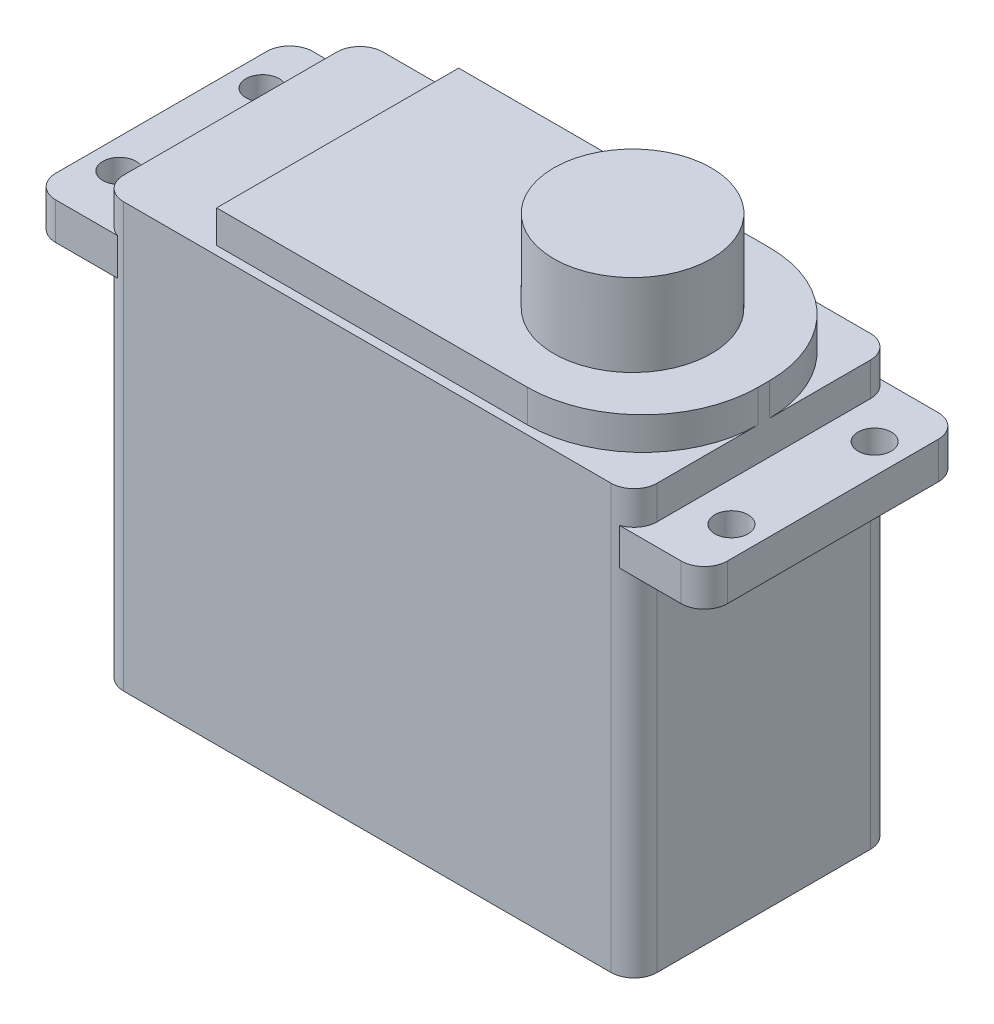
ISO-10303-21;
HEADER;
FILE_DESCRIPTION(('STEP AP214'),'2;1');
FILE_NAME('part.step','',(''),(''),'','','');
FILE_SCHEMA(('AUTOMOTIVE_DESIGN { 1 0 10303 214 1 1 1 1 }'));
ENDSEC;
DATA;
#1=APPLICATION_CONTEXT('core data for automotive mechanical design processes');
#2=APPLICATION_PROTOCOL_DEFINITION('international standard','automotive_design',2000,#1);
#3=PRODUCT_CONTEXT('',#1,'mechanical');
#4=PRODUCT('Part','Part','',(#3));
#5=PRODUCT_RELATED_PRODUCT_CATEGORY('part','',(#4));
#6=PRODUCT_DEFINITION_FORMATION('','',#4);
#7=PRODUCT_DEFINITION_CONTEXT('part definition',#1,'design');
#8=PRODUCT_DEFINITION('design','',#6,#7);
#9=PRODUCT_DEFINITION_SHAPE('','',#8);
#10=(LENGTH_UNIT() NAMED_UNIT(*) SI_UNIT(.MILLI.,.METRE.));
#11=(NAMED_UNIT(*) PLANE_ANGLE_UNIT() SI_UNIT($,.RADIAN.));
#12=(NAMED_UNIT(*) SI_UNIT($,.STERADIAN.) SOLID_ANGLE_UNIT());
#13=UNCERTAINTY_MEASURE_WITH_UNIT(LENGTH_MEASURE(1.E-05),#10,'distance_accuracy_value','');
#14=(GEOMETRIC_REPRESENTATION_CONTEXT(3) GLOBAL_UNCERTAINTY_ASSIGNED_CONTEXT((#13)) GLOBAL_UNIT_ASSIGNED_CONTEXT((#10,
#11,#12)) REPRESENTATION_CONTEXT('',''));
#15=CARTESIAN_POINT('',(0.,0.,0.));
#16=DIRECTION('',(0.,0.,1.));
#17=DIRECTION('',(1.,0.,0.));
#18=AXIS2_PLACEMENT_3D('',#15,#16,#17);
#19=CARTESIAN_POINT('',(0.,50.1904,0.));
#20=DIRECTION('',(0.,-1.,0.));
#21=DIRECTION('',(0.,0.,-1.));
#22=AXIS2_PLACEMENT_3D('',#19,#20,#21);
#23=PLANE('',#22);
#24=DIRECTION('',(1.,0.,0.));
#25=VECTOR('',#24,1.);
#26=CARTESIAN_POINT('',(29.337,50.1904,13.3096));
#27=LINE('',#26,#25);
#28=CARTESIAN_POINT('',(-17.526,50.1904,13.3096));
#29=VERTEX_POINT('',#28);
#30=CARTESIAN_POINT('',(16.637,50.1904,13.3096));
#31=VERTEX_POINT('',#30);
#32=EDGE_CURVE('E270',#29,#31,#27,.T.);
#33=ORIENTED_EDGE('',*,*,#32,.T.);
#34=CARTESIAN_POINT('',(16.637,50.1904,0.609600000000004));
#35=DIRECTION('',(0.,-1.,0.));
#36=DIRECTION('',(0.,0.,-1.));
#37=AXIS2_PLACEMENT_3D('',#34,#35,#36);
#38=CIRCLE('',#37,12.7);
#39=CARTESIAN_POINT('',(29.337,50.1904,0.609600000000004));
#40=VERTEX_POINT('',#39);
#41=EDGE_CURVE('E299',#31,#40,#38,.F.);
#42=ORIENTED_EDGE('',*,*,#41,.T.);
#43=DIRECTION('',(0.,0.,-1.));
#44=VECTOR('',#43,1.);
#45=CARTESIAN_POINT('',(29.337,50.1904,13.3096));
#46=LINE('',#45,#44);
#47=CARTESIAN_POINT('',(29.337,50.1904,-0.609600000000014));
#48=VERTEX_POINT('',#47);
#49=EDGE_CURVE('E273',#40,#48,#46,.T.);
#50=ORIENTED_EDGE('',*,*,#49,.T.);
#51=CARTESIAN_POINT('',(16.637,50.1904,-0.609600000000013));
#52=DIRECTION('',(0.,-1.,0.));
#53=DIRECTION('',(0.,0.,-1.));
#54=AXIS2_PLACEMENT_3D('',#51,#52,#53);
#55=CIRCLE('',#54,12.7);
#56=CARTESIAN_POINT('',(16.637,50.1904,-13.3096));
#57=VERTEX_POINT('',#56);
#58=EDGE_CURVE('E297',#48,#57,#55,.F.);
#59=ORIENTED_EDGE('',*,*,#58,.T.);
#60=DIRECTION('',(-1.,0.,0.));
#61=VECTOR('',#60,1.);
#62=CARTESIAN_POINT('',(29.337,50.1904,-13.3096));
#63=LINE('',#62,#61);
#64=CARTESIAN_POINT('',(-17.526,50.1904,-13.3096));
#65=VERTEX_POINT('',#64);
#66=EDGE_CURVE('E277',#57,#65,#63,.T.);
#67=ORIENTED_EDGE('',*,*,#66,.T.);
#68=DIRECTION('',(0.,0.,1.));
#69=VECTOR('',#68,1.);
#70=CARTESIAN_POINT('',(-17.526,50.1904,13.3096));
#71=LINE('',#70,#69);
#72=EDGE_CURVE('E279',#65,#29,#71,.T.);
#73=ORIENTED_EDGE('',*,*,#72,.T.);
#74=EDGE_LOOP('',(#33,#42,#50,#59,#67,#73));
#75=FACE_BOUND('',#74,.T.);
#76=CARTESIAN_POINT('',(14.9098,50.1904,0.));
#77=DIRECTION('',(0.,-1.,0.));
#78=DIRECTION('',(0.,0.,-1.));
#79=AXIS2_PLACEMENT_3D('',#76,#77,#78);
#80=CIRCLE('',#79,8.6614);
#81=CARTESIAN_POINT('',(14.9098,50.1904,-8.66140000000001));
#82=VERTEX_POINT('',#81);
#83=EDGE_CURVE('E11',#82,#82,#80,.F.);
#84=ORIENTED_EDGE('',*,*,#83,.F.);
#85=EDGE_LOOP('',(#84));
#86=FACE_BOUND('',#85,.T.);
#87=ADVANCED_FACE('F33',(#75,#86),#23,.F.);
#88=CARTESIAN_POINT('',(-29.337,46.609,14.2621));
#89=DIRECTION('',(1.,0.,0.));
#90=DIRECTION('',(0.,0.,-1.));
#91=AXIS2_PLACEMENT_3D('',#88,#89,#90);
#92=PLANE('',#91);
#93=DIRECTION('',(0.,0.,1.));
#94=VECTOR('',#93,1.);
#95=CARTESIAN_POINT('',(-29.337,38.862,14.2621));
#96=LINE('',#95,#94);
#97=CARTESIAN_POINT('',(-29.337,38.862,-11.7221));
#98=VERTEX_POINT('',#97);
#99=CARTESIAN_POINT('',(-29.337,38.862,11.7221));
#100=VERTEX_POINT('',#99);
#101=EDGE_CURVE('E474',#98,#100,#96,.T.);
#102=ORIENTED_EDGE('',*,*,#101,.F.);
#103=DIRECTION('',(0.,-1.,0.));
#104=VECTOR('',#103,1.);
#105=CARTESIAN_POINT('',(-29.337,46.609,-11.7221));
#106=LINE('',#105,#104);
#107=CARTESIAN_POINT('',(-29.337,0.,-11.7221));
#108=VERTEX_POINT('',#107);
#109=EDGE_CURVE('E386',#98,#108,#106,.T.);
#110=ORIENTED_EDGE('',*,*,#109,.T.);
#111=DIRECTION('',(0.,0.,1.));
#112=VECTOR('',#111,1.);
#113=CARTESIAN_POINT('',(-29.337,0.,14.2621));
#114=LINE('',#113,#112);
#115=CARTESIAN_POINT('',(-29.337,0.,11.7221));
#116=VERTEX_POINT('',#115);
#117=EDGE_CURVE('E335',#108,#116,#114,.T.);
#118=ORIENTED_EDGE('',*,*,#117,.T.);
#119=DIRECTION('',(0.,-1.,0.));
#120=VECTOR('',#119,1.);
#121=CARTESIAN_POINT('',(-29.337,46.609,11.7221));
#122=LINE('',#121,#120);
#123=EDGE_CURVE('E384',#116,#100,#122,.F.);
#124=ORIENTED_EDGE('',*,*,#123,.T.);
#125=EDGE_LOOP('',(#102,#110,#118,#124));
#126=FACE_BOUND('',#125,.T.);
#127=ADVANCED_FACE('F586',(#126),#92,.F.);
#128=CARTESIAN_POINT('',(29.337,46.609,14.2621));
#129=DIRECTION('',(-1.,0.,0.));
#130=DIRECTION('',(0.,0.,1.));
#131=AXIS2_PLACEMENT_3D('',#128,#129,#130);
#132=PLANE('',#131);
#133=DIRECTION('',(0.,0.,-1.));
#134=VECTOR('',#133,1.);
#135=CARTESIAN_POINT('',(29.337,38.862,14.2621));
#136=LINE('',#135,#134);
#137=CARTESIAN_POINT('',(29.337,38.862,11.7221));
#138=VERTEX_POINT('',#137);
#139=CARTESIAN_POINT('',(29.337,38.862,-11.7221));
#140=VERTEX_POINT('',#139);
#141=EDGE_CURVE('E250',#138,#140,#136,.T.);
#142=ORIENTED_EDGE('',*,*,#141,.F.);
#143=DIRECTION('',(0.,-1.,0.));
#144=VECTOR('',#143,1.);
#145=CARTESIAN_POINT('',(29.337,46.609,11.7221));
#146=LINE('',#145,#144);
#147=CARTESIAN_POINT('',(29.337,0.,11.7221));
#148=VERTEX_POINT('',#147);
#149=EDGE_CURVE('E503',#138,#148,#146,.T.);
#150=ORIENTED_EDGE('',*,*,#149,.T.);
#151=DIRECTION('',(0.,0.,-1.));
#152=VECTOR('',#151,1.);
#153=CARTESIAN_POINT('',(29.337,0.,14.2621));
#154=LINE('',#153,#152);
#155=CARTESIAN_POINT('',(29.337,0.,-11.7221));
#156=VERTEX_POINT('',#155);
#157=EDGE_CURVE('E330',#148,#156,#154,.T.);
#158=ORIENTED_EDGE('',*,*,#157,.T.);
#159=DIRECTION('',(0.,-1.,0.));
#160=VECTOR('',#159,1.);
#161=CARTESIAN_POINT('',(29.337,46.609,-11.7221));
#162=LINE('',#161,#160);
#163=EDGE_CURVE('E315',#156,#140,#162,.F.);
#164=ORIENTED_EDGE('',*,*,#163,.T.);
#165=EDGE_LOOP('',(#142,#150,#158,#164));
#166=FACE_BOUND('',#165,.T.);
#167=ADVANCED_FACE('F505',(#166),#132,.F.);
#168=CARTESIAN_POINT('',(-29.337,46.609,-11.7221));
#169=VERTEX_POINT('',#168);
#170=CARTESIAN_POINT('',(-29.337,42.926,-11.7221));
#171=VERTEX_POINT('',#170);
#172=EDGE_CURVE('E387',#169,#171,#106,.T.);
#173=ORIENTED_EDGE('',*,*,#172,.T.);
#174=DIRECTION('',(0.,0.,1.));
#175=VECTOR('',#174,1.);
#176=CARTESIAN_POINT('',(-29.337,42.926,14.2621));
#177=LINE('',#176,#175);
#178=CARTESIAN_POINT('',(-29.337,42.926,11.7221));
#179=VERTEX_POINT('',#178);
#180=EDGE_CURVE('E490',#171,#179,#177,.T.);
#181=ORIENTED_EDGE('',*,*,#180,.T.);
#182=CARTESIAN_POINT('',(-29.337,46.609,11.7221));
#183=VERTEX_POINT('',#182);
#184=EDGE_CURVE('E383',#179,#183,#122,.F.);
#185=ORIENTED_EDGE('',*,*,#184,.T.);
#186=DIRECTION('',(0.,0.,1.));
#187=VECTOR('',#186,1.);
#188=CARTESIAN_POINT('',(-29.337,46.609,14.2621));
#189=LINE('',#188,#187);
#190=EDGE_CURVE('E329',#169,#183,#189,.T.);
#191=ORIENTED_EDGE('',*,*,#190,.F.);
#192=EDGE_LOOP('',(#173,#181,#185,#191));
#193=FACE_BOUND('',#192,.T.);
#194=ADVANCED_FACE('F539',(#193),#92,.F.);
#195=CARTESIAN_POINT('',(29.337,46.609,14.2621));
#196=DIRECTION('',(0.,0.,-1.));
#197=DIRECTION('',(-1.,0.,0.));
#198=AXIS2_PLACEMENT_3D('',#195,#196,#197);
#199=PLANE('',#198);
#200=DIRECTION('',(1.,0.,0.));
#201=VECTOR('',#200,1.);
#202=CARTESIAN_POINT('',(29.337,0.,14.2621));
#203=LINE('',#202,#201);
#204=CARTESIAN_POINT('',(-26.797,0.,14.2621));
#205=VERTEX_POINT('',#204);
#206=CARTESIAN_POINT('',(26.797,0.,14.2621));
#207=VERTEX_POINT('',#206);
#208=EDGE_CURVE('E333',#205,#207,#203,.T.);
#209=ORIENTED_EDGE('',*,*,#208,.T.);
#210=DIRECTION('',(0.,-1.,0.));
#211=VECTOR('',#210,1.);
#212=CARTESIAN_POINT('',(26.797,46.609,14.2621));
#213=LINE('',#212,#211);
#214=CARTESIAN_POINT('',(26.797,46.609,14.2621));
#215=VERTEX_POINT('',#214);
#216=EDGE_CURVE('E369',#207,#215,#213,.F.);
#217=ORIENTED_EDGE('',*,*,#216,.T.);
#218=DIRECTION('',(1.,0.,0.));
#219=VECTOR('',#218,1.);
#220=CARTESIAN_POINT('',(29.337,46.609,14.2621));
#221=LINE('',#220,#219);
#222=CARTESIAN_POINT('',(-26.797,46.609,14.2621));
#223=VERTEX_POINT('',#222);
#224=EDGE_CURVE('E320',#223,#215,#221,.T.);
#225=ORIENTED_EDGE('',*,*,#224,.F.);
#226=DIRECTION('',(0.,-1.,0.));
#227=VECTOR('',#226,1.);
#228=CARTESIAN_POINT('',(-26.797,46.609,14.2621));
#229=LINE('',#228,#227);
#230=EDGE_CURVE('E533',#223,#205,#229,.T.);
#231=ORIENTED_EDGE('',*,*,#230,.T.);
#232=EDGE_LOOP('',(#209,#217,#225,#231));
#233=FACE_BOUND('',#232,.T.);
#234=ADVANCED_FACE('F575',(#233),#199,.F.);
#235=CARTESIAN_POINT('',(29.337,46.609,11.7221));
#236=VERTEX_POINT('',#235);
#237=CARTESIAN_POINT('',(29.337,42.926,11.7221));
#238=VERTEX_POINT('',#237);
#239=EDGE_CURVE('E371',#236,#238,#146,.T.);
#240=ORIENTED_EDGE('',*,*,#239,.T.);
#241=DIRECTION('',(0.,0.,-1.));
#242=VECTOR('',#241,1.);
#243=CARTESIAN_POINT('',(29.337,42.926,14.2621));
#244=LINE('',#243,#242);
#245=CARTESIAN_POINT('',(29.337,42.926,-11.7221));
#246=VERTEX_POINT('',#245);
#247=EDGE_CURVE('E496',#238,#246,#244,.T.);
#248=ORIENTED_EDGE('',*,*,#247,.T.);
#249=CARTESIAN_POINT('',(29.337,46.609,-11.7221));
#250=VERTEX_POINT('',#249);
#251=EDGE_CURVE('E310',#246,#250,#162,.F.);
#252=ORIENTED_EDGE('',*,*,#251,.T.);
#253=DIRECTION('',(0.,0.,-1.));
#254=VECTOR('',#253,1.);
#255=CARTESIAN_POINT('',(29.337,46.609,14.2621));
#256=LINE('',#255,#254);
#257=CARTESIAN_POINT('',(29.337,46.609,-0.609600000000013));
#258=VERTEX_POINT('',#257);
#259=EDGE_CURVE('E314',#258,#250,#256,.T.);
#260=ORIENTED_EDGE('',*,*,#259,.F.);
#261=DIRECTION('',(0.,-1.,0.));
#262=VECTOR('',#261,1.);
#263=CARTESIAN_POINT('',(29.337,46.609,-0.609600000000014));
#264=LINE('',#263,#262);
#265=EDGE_CURVE('E289',#258,#48,#264,.F.);
#266=ORIENTED_EDGE('',*,*,#265,.T.);
#267=ORIENTED_EDGE('',*,*,#49,.F.);
#268=DIRECTION('',(0.,-1.,0.));
#269=VECTOR('',#268,1.);
#270=CARTESIAN_POINT('',(29.337,46.609,0.609600000000004));
#271=LINE('',#270,#269);
#272=CARTESIAN_POINT('',(29.337,46.609,0.609600000000007));
#273=VERTEX_POINT('',#272);
#274=EDGE_CURVE('E291',#40,#273,#271,.T.);
#275=ORIENTED_EDGE('',*,*,#274,.T.);
#276=EDGE_CURVE('E311',#236,#273,#256,.T.);
#277=ORIENTED_EDGE('',*,*,#276,.F.);
#278=EDGE_LOOP('',(#240,#248,#252,#260,#266,#267,#275,#277));
#279=FACE_BOUND('',#278,.T.);
#280=ADVANCED_FACE('F508',(#279),#132,.F.);
#281=CARTESIAN_POINT('',(29.337,46.609,-14.2621));
#282=DIRECTION('',(0.,0.,1.));
#283=DIRECTION('',(1.,0.,0.));
#284=AXIS2_PLACEMENT_3D('',#281,#282,#283);
#285=PLANE('',#284);
#286=DIRECTION('',(-1.,0.,0.));
#287=VECTOR('',#286,1.);
#288=CARTESIAN_POINT('',(29.337,46.609,-14.2621));
#289=LINE('',#288,#287);
#290=CARTESIAN_POINT('',(26.797,46.609,-14.2621));
#291=VERTEX_POINT('',#290);
#292=CARTESIAN_POINT('',(-26.797,46.609,-14.2621));
#293=VERTEX_POINT('',#292);
#294=EDGE_CURVE('E292',#291,#293,#289,.T.);
#295=ORIENTED_EDGE('',*,*,#294,.F.);
#296=DIRECTION('',(0.,-1.,0.));
#297=VECTOR('',#296,1.);
#298=CARTESIAN_POINT('',(26.797,46.609,-14.2621));
#299=LINE('',#298,#297);
#300=CARTESIAN_POINT('',(26.797,0.,-14.2621));
#301=VERTEX_POINT('',#300);
#302=EDGE_CURVE('E375',#291,#301,#299,.T.);
#303=ORIENTED_EDGE('',*,*,#302,.T.);
#304=DIRECTION('',(-1.,0.,0.));
#305=VECTOR('',#304,1.);
#306=CARTESIAN_POINT('',(29.337,0.,-14.2621));
#307=LINE('',#306,#305);
#308=CARTESIAN_POINT('',(-26.797,0.,-14.2621));
#309=VERTEX_POINT('',#308);
#310=EDGE_CURVE('E326',#301,#309,#307,.T.);
#311=ORIENTED_EDGE('',*,*,#310,.T.);
#312=DIRECTION('',(0.,-1.,0.));
#313=VECTOR('',#312,1.);
#314=CARTESIAN_POINT('',(-26.797,46.609,-14.2621));
#315=LINE('',#314,#313);
#316=EDGE_CURVE('E372',#309,#293,#315,.F.);
#317=ORIENTED_EDGE('',*,*,#316,.T.);
#318=EDGE_LOOP('',(#295,#303,#311,#317));
#319=FACE_BOUND('',#318,.T.);
#320=ADVANCED_FACE('F518',(#319),#285,.F.);
#321=CARTESIAN_POINT('',(0.,46.609,0.));
#322=DIRECTION('',(0.,1.,0.));
#323=DIRECTION('',(0.,0.,1.));
#324=AXIS2_PLACEMENT_3D('',#321,#322,#323);
#325=PLANE('',#324);
#326=ORIENTED_EDGE('',*,*,#224,.T.);
#327=CARTESIAN_POINT('',(26.797,46.609,11.7221));
#328=DIRECTION('',(0.,1.,0.));
#329=DIRECTION('',(0.,0.,1.));
#330=AXIS2_PLACEMENT_3D('',#327,#328,#329);
#331=CIRCLE('',#330,2.54);
#332=EDGE_CURVE('E357',#215,#236,#331,.T.);
#333=ORIENTED_EDGE('',*,*,#332,.T.);
#334=ORIENTED_EDGE('',*,*,#276,.T.);
#335=CARTESIAN_POINT('',(16.637,46.609,0.609600000000004));
#336=DIRECTION('',(0.,1.,0.));
#337=DIRECTION('',(0.,0.,1.));
#338=AXIS2_PLACEMENT_3D('',#335,#336,#337);
#339=CIRCLE('',#338,12.7);
#340=CARTESIAN_POINT('',(16.637,46.609,13.3096));
#341=VERTEX_POINT('',#340);
#342=EDGE_CURVE('E305',#273,#341,#339,.F.);
#343=ORIENTED_EDGE('',*,*,#342,.T.);
#344=DIRECTION('',(1.,0.,0.));
#345=VECTOR('',#344,1.);
#346=CARTESIAN_POINT('',(29.337,46.609,13.3096));
#347=LINE('',#346,#345);
#348=CARTESIAN_POINT('',(-17.526,46.609,13.3096));
#349=VERTEX_POINT('',#348);
#350=EDGE_CURVE('E259',#349,#341,#347,.T.);
#351=ORIENTED_EDGE('',*,*,#350,.F.);
#352=DIRECTION('',(0.,0.,1.));
#353=VECTOR('',#352,1.);
#354=CARTESIAN_POINT('',(-17.526,46.609,13.3096));
#355=LINE('',#354,#353);
#356=CARTESIAN_POINT('',(-17.526,46.609,-13.3096));
#357=VERTEX_POINT('',#356);
#358=EDGE_CURVE('E274',#357,#349,#355,.T.);
#359=ORIENTED_EDGE('',*,*,#358,.F.);
#360=DIRECTION('',(-1.,0.,0.));
#361=VECTOR('',#360,1.);
#362=CARTESIAN_POINT('',(29.337,46.609,-13.3096));
#363=LINE('',#362,#361);
#364=CARTESIAN_POINT('',(16.637,46.609,-13.3096));
#365=VERTEX_POINT('',#364);
#366=EDGE_CURVE('E263',#365,#357,#363,.T.);
#367=ORIENTED_EDGE('',*,*,#366,.F.);
#368=CARTESIAN_POINT('',(16.637,46.609,-0.609600000000013));
#369=DIRECTION('',(0.,1.,0.));
#370=DIRECTION('',(0.,0.,1.));
#371=AXIS2_PLACEMENT_3D('',#368,#369,#370);
#372=CIRCLE('',#371,12.7);
#373=EDGE_CURVE('E307',#365,#258,#372,.F.);
#374=ORIENTED_EDGE('',*,*,#373,.T.);
#375=ORIENTED_EDGE('',*,*,#259,.T.);
#376=CARTESIAN_POINT('',(26.797,46.609,-11.7221));
#377=DIRECTION('',(0.,1.,0.));
#378=DIRECTION('',(0.,0.,1.));
#379=AXIS2_PLACEMENT_3D('',#376,#377,#378);
#380=CIRCLE('',#379,2.54);
#381=EDGE_CURVE('E373',#250,#291,#380,.T.);
#382=ORIENTED_EDGE('',*,*,#381,.T.);
#383=ORIENTED_EDGE('',*,*,#294,.T.);
#384=CARTESIAN_POINT('',(-26.797,46.609,-11.7221));
#385=DIRECTION('',(0.,1.,0.));
#386=DIRECTION('',(0.,0.,1.));
#387=AXIS2_PLACEMENT_3D('',#384,#385,#386);
#388=CIRCLE('',#387,2.54);
#389=EDGE_CURVE('E377',#293,#169,#388,.T.);
#390=ORIENTED_EDGE('',*,*,#389,.T.);
#391=ORIENTED_EDGE('',*,*,#190,.T.);
#392=CARTESIAN_POINT('',(-26.797,46.609,11.7221));
#393=DIRECTION('',(0.,1.,0.));
#394=DIRECTION('',(0.,0.,1.));
#395=AXIS2_PLACEMENT_3D('',#392,#393,#394);
#396=CIRCLE('',#395,2.54);
#397=EDGE_CURVE('E359',#183,#223,#396,.T.);
#398=ORIENTED_EDGE('',*,*,#397,.T.);
#399=EDGE_LOOP('',(#326,#333,#334,#343,#351,#359,#367,#374,#375,#382,#383,#390,#391,#398));
#400=FACE_BOUND('',#399,.T.);
#401=ADVANCED_FACE('F356',(#400),#325,.T.);
#402=CARTESIAN_POINT('',(0.,0.,0.));
#403=DIRECTION('',(0.,1.,0.));
#404=DIRECTION('',(0.,0.,1.));
#405=AXIS2_PLACEMENT_3D('',#402,#403,#404);
#406=PLANE('',#405);
#407=ORIENTED_EDGE('',*,*,#157,.F.);
#408=CARTESIAN_POINT('',(26.797,0.,11.7221));
#409=DIRECTION('',(0.,1.,0.));
#410=DIRECTION('',(0.,0.,1.));
#411=AXIS2_PLACEMENT_3D('',#408,#409,#410);
#412=CIRCLE('',#411,2.54);
#413=EDGE_CURVE('E528',#148,#207,#412,.F.);
#414=ORIENTED_EDGE('',*,*,#413,.T.);
#415=ORIENTED_EDGE('',*,*,#208,.F.);
#416=CARTESIAN_POINT('',(-26.797,0.,11.7221));
#417=DIRECTION('',(0.,1.,0.));
#418=DIRECTION('',(0.,0.,1.));
#419=AXIS2_PLACEMENT_3D('',#416,#417,#418);
#420=CIRCLE('',#419,2.54);
#421=EDGE_CURVE('E526',#205,#116,#420,.F.);
#422=ORIENTED_EDGE('',*,*,#421,.T.);
#423=ORIENTED_EDGE('',*,*,#117,.F.);
#424=CARTESIAN_POINT('',(-26.797,0.,-11.7221));
#425=DIRECTION('',(0.,1.,0.));
#426=DIRECTION('',(0.,0.,1.));
#427=AXIS2_PLACEMENT_3D('',#424,#425,#426);
#428=CIRCLE('',#427,2.54);
#429=EDGE_CURVE('E523',#108,#309,#428,.F.);
#430=ORIENTED_EDGE('',*,*,#429,.T.);
#431=ORIENTED_EDGE('',*,*,#310,.F.);
#432=CARTESIAN_POINT('',(26.797,0.,-11.7221));
#433=DIRECTION('',(0.,1.,0.));
#434=DIRECTION('',(0.,0.,1.));
#435=AXIS2_PLACEMENT_3D('',#432,#433,#434);
#436=CIRCLE('',#435,2.54);
#437=EDGE_CURVE('E515',#301,#156,#436,.F.);
#438=ORIENTED_EDGE('',*,*,#437,.T.);
#439=EDGE_LOOP('',(#407,#414,#415,#422,#423,#430,#431,#438));
#440=FACE_BOUND('',#439,.T.);
#441=ADVANCED_FACE('F521',(#440),#406,.F.);
#442=CARTESIAN_POINT('',(29.337,50.1904,13.3096));
#443=DIRECTION('',(0.,0.,-1.));
#444=DIRECTION('',(-1.,0.,0.));
#445=AXIS2_PLACEMENT_3D('',#442,#443,#444);
#446=PLANE('',#445);
#447=ORIENTED_EDGE('',*,*,#350,.T.);
#448=DIRECTION('',(0.,-1.,0.));
#449=VECTOR('',#448,1.);
#450=CARTESIAN_POINT('',(16.637,50.1904,13.3096));
#451=LINE('',#450,#449);
#452=EDGE_CURVE('E295',#341,#31,#451,.F.);
#453=ORIENTED_EDGE('',*,*,#452,.T.);
#454=ORIENTED_EDGE('',*,*,#32,.F.);
#455=DIRECTION('',(0.,-1.,0.));
#456=VECTOR('',#455,1.);
#457=CARTESIAN_POINT('',(-17.526,50.1904,13.3096));
#458=LINE('',#457,#456);
#459=EDGE_CURVE('E281',#29,#349,#458,.T.);
#460=ORIENTED_EDGE('',*,*,#459,.T.);
#461=EDGE_LOOP('',(#447,#453,#454,#460));
#462=FACE_BOUND('',#461,.T.);
#463=ADVANCED_FACE('F606',(#462),#446,.F.);
#464=CARTESIAN_POINT('',(29.337,50.1904,-13.3096));
#465=DIRECTION('',(0.,0.,1.));
#466=DIRECTION('',(1.,0.,0.));
#467=AXIS2_PLACEMENT_3D('',#464,#465,#466);
#468=PLANE('',#467);
#469=ORIENTED_EDGE('',*,*,#66,.F.);
#470=DIRECTION('',(0.,-1.,0.));
#471=VECTOR('',#470,1.);
#472=CARTESIAN_POINT('',(16.637,50.1904,-13.3096));
#473=LINE('',#472,#471);
#474=EDGE_CURVE('E301',#57,#365,#473,.T.);
#475=ORIENTED_EDGE('',*,*,#474,.T.);
#476=ORIENTED_EDGE('',*,*,#366,.T.);
#477=DIRECTION('',(0.,-1.,0.));
#478=VECTOR('',#477,1.);
#479=CARTESIAN_POINT('',(-17.526,50.1904,-13.3096));
#480=LINE('',#479,#478);
#481=EDGE_CURVE('E337',#65,#357,#480,.T.);
#482=ORIENTED_EDGE('',*,*,#481,.F.);
#483=EDGE_LOOP('',(#469,#475,#476,#482));
#484=FACE_BOUND('',#483,.T.);
#485=ADVANCED_FACE('F603',(#484),#468,.F.);
#486=CARTESIAN_POINT('',(-17.526,50.1904,13.3096));
#487=DIRECTION('',(1.,0.,0.));
#488=DIRECTION('',(0.,0.,-1.));
#489=AXIS2_PLACEMENT_3D('',#486,#487,#488);
#490=PLANE('',#489);
#491=ORIENTED_EDGE('',*,*,#358,.T.);
#492=ORIENTED_EDGE('',*,*,#459,.F.);
#493=ORIENTED_EDGE('',*,*,#72,.F.);
#494=ORIENTED_EDGE('',*,*,#481,.T.);
#495=EDGE_LOOP('',(#491,#492,#493,#494));
#496=FACE_BOUND('',#495,.T.);
#497=ADVANCED_FACE('F599',(#496),#490,.F.);
#498=CARTESIAN_POINT('',(16.637,46.609,0.609600000000004));
#499=DIRECTION('',(0.,-1.,0.));
#500=DIRECTION('',(0.,0.,-1.));
#501=AXIS2_PLACEMENT_3D('',#498,#499,#500);
#502=CYLINDRICAL_SURFACE('',#501,12.7);
#503=ORIENTED_EDGE('',*,*,#41,.F.);
#504=ORIENTED_EDGE('',*,*,#452,.F.);
#505=ORIENTED_EDGE('',*,*,#342,.F.);
#506=ORIENTED_EDGE('',*,*,#274,.F.);
#507=EDGE_LOOP('',(#503,#504,#505,#506));
#508=FACE_BOUND('',#507,.T.);
#509=ADVANCED_FACE('F602',(#508),#502,.T.);
#510=CARTESIAN_POINT('',(16.637,50.1904,-0.609600000000013));
#511=DIRECTION('',(0.,-1.,0.));
#512=DIRECTION('',(0.,0.,-1.));
#513=AXIS2_PLACEMENT_3D('',#510,#511,#512);
#514=CYLINDRICAL_SURFACE('',#513,12.7);
#515=ORIENTED_EDGE('',*,*,#58,.F.);
#516=ORIENTED_EDGE('',*,*,#265,.F.);
#517=ORIENTED_EDGE('',*,*,#373,.F.);
#518=ORIENTED_EDGE('',*,*,#474,.F.);
#519=EDGE_LOOP('',(#515,#516,#517,#518));
#520=FACE_BOUND('',#519,.T.);
#521=ADVANCED_FACE('F652',(#520),#514,.T.);
#522=CARTESIAN_POINT('',(26.797,46.609,11.7221));
#523=DIRECTION('',(0.,-1.,0.));
#524=DIRECTION('',(0.,0.,-1.));
#525=AXIS2_PLACEMENT_3D('',#522,#523,#524);
#526=CYLINDRICAL_SURFACE('',#525,2.54);
#527=CARTESIAN_POINT('',(26.797,42.926,11.7221));
#528=DIRECTION('',(0.,1.,0.));
#529=DIRECTION('',(0.,0.,1.));
#530=AXIS2_PLACEMENT_3D('',#527,#528,#529);
#531=CIRCLE('',#530,2.54);
#532=CARTESIAN_POINT('',(27.5901147457966,42.926,14.1351));
#533=VERTEX_POINT('',#532);
#534=EDGE_CURVE('E266',#238,#533,#531,.F.);
#535=ORIENTED_EDGE('',*,*,#534,.F.);
#536=ORIENTED_EDGE('',*,*,#239,.F.);
#537=ORIENTED_EDGE('',*,*,#332,.F.);
#538=ORIENTED_EDGE('',*,*,#216,.F.);
#539=ORIENTED_EDGE('',*,*,#413,.F.);
#540=ORIENTED_EDGE('',*,*,#149,.F.);
#541=CARTESIAN_POINT('',(26.797,38.862,11.7221));
#542=DIRECTION('',(0.,1.,0.));
#543=DIRECTION('',(0.,0.,1.));
#544=AXIS2_PLACEMENT_3D('',#541,#542,#543);
#545=CIRCLE('',#544,2.54);
#546=CARTESIAN_POINT('',(27.5901147457966,38.862,14.1351));
#547=VERTEX_POINT('',#546);
#548=EDGE_CURVE('E487',#138,#547,#545,.F.);
#549=ORIENTED_EDGE('',*,*,#548,.T.);
#550=DIRECTION('',(0.,-1.,0.));
#551=VECTOR('',#550,1.);
#552=CARTESIAN_POINT('',(27.5901147457966,46.609,14.1351));
#553=LINE('',#552,#551);
#554=EDGE_CURVE('E260',#547,#533,#553,.F.);
#555=ORIENTED_EDGE('',*,*,#554,.T.);
#556=EDGE_LOOP('',(#535,#536,#537,#538,#539,#540,#549,#555));
#557=FACE_BOUND('',#556,.T.);
#558=ADVANCED_FACE('F367',(#557),#526,.T.);
#559=CARTESIAN_POINT('',(26.797,46.609,-11.7221));
#560=DIRECTION('',(0.,-1.,0.));
#561=DIRECTION('',(0.,0.,-1.));
#562=AXIS2_PLACEMENT_3D('',#559,#560,#561);
#563=CYLINDRICAL_SURFACE('',#562,2.54);
#564=CARTESIAN_POINT('',(26.797,42.926,-11.7221));
#565=DIRECTION('',(0.,1.,0.));
#566=DIRECTION('',(0.,0.,1.));
#567=AXIS2_PLACEMENT_3D('',#564,#565,#566);
#568=CIRCLE('',#567,2.54);
#569=CARTESIAN_POINT('',(27.5901147457966,42.926,-14.1351));
#570=VERTEX_POINT('',#569);
#571=EDGE_CURVE('E258',#570,#246,#568,.F.);
#572=ORIENTED_EDGE('',*,*,#571,.F.);
#573=DIRECTION('',(0.,-1.,0.));
#574=VECTOR('',#573,1.);
#575=CARTESIAN_POINT('',(27.5901147457966,46.609,-14.1351));
#576=LINE('',#575,#574);
#577=CARTESIAN_POINT('',(27.5901147457966,38.862,-14.1351));
#578=VERTEX_POINT('',#577);
#579=EDGE_CURVE('E238',#570,#578,#576,.T.);
#580=ORIENTED_EDGE('',*,*,#579,.T.);
#581=CARTESIAN_POINT('',(26.797,38.862,-11.7221));
#582=DIRECTION('',(0.,1.,0.));
#583=DIRECTION('',(0.,0.,1.));
#584=AXIS2_PLACEMENT_3D('',#581,#582,#583);
#585=CIRCLE('',#584,2.54);
#586=EDGE_CURVE('E246',#578,#140,#585,.F.);
#587=ORIENTED_EDGE('',*,*,#586,.T.);
#588=ORIENTED_EDGE('',*,*,#163,.F.);
#589=ORIENTED_EDGE('',*,*,#437,.F.);
#590=ORIENTED_EDGE('',*,*,#302,.F.);
#591=ORIENTED_EDGE('',*,*,#381,.F.);
#592=ORIENTED_EDGE('',*,*,#251,.F.);
#593=EDGE_LOOP('',(#572,#580,#587,#588,#589,#590,#591,#592));
#594=FACE_BOUND('',#593,.T.);
#595=ADVANCED_FACE('F256',(#594),#563,.T.);
#596=CARTESIAN_POINT('',(-26.797,46.609,-11.7221));
#597=DIRECTION('',(0.,-1.,0.));
#598=DIRECTION('',(0.,0.,-1.));
#599=AXIS2_PLACEMENT_3D('',#596,#597,#598);
#600=CYLINDRICAL_SURFACE('',#599,2.54);
#601=CARTESIAN_POINT('',(-26.797,42.926,-11.7221));
#602=DIRECTION('',(0.,1.,0.));
#603=DIRECTION('',(0.,0.,1.));
#604=AXIS2_PLACEMENT_3D('',#601,#602,#603);
#605=CIRCLE('',#604,2.54);
#606=CARTESIAN_POINT('',(-27.5901147457966,42.926,-14.1351));
#607=VERTEX_POINT('',#606);
#608=EDGE_CURVE('E493',#171,#607,#605,.F.);
#609=ORIENTED_EDGE('',*,*,#608,.F.);
#610=ORIENTED_EDGE('',*,*,#172,.F.);
#611=ORIENTED_EDGE('',*,*,#389,.F.);
#612=ORIENTED_EDGE('',*,*,#316,.F.);
#613=ORIENTED_EDGE('',*,*,#429,.F.);
#614=ORIENTED_EDGE('',*,*,#109,.F.);
#615=CARTESIAN_POINT('',(-26.797,38.862,-11.7221));
#616=DIRECTION('',(0.,1.,0.));
#617=DIRECTION('',(0.,0.,1.));
#618=AXIS2_PLACEMENT_3D('',#615,#616,#617);
#619=CIRCLE('',#618,2.54);
#620=CARTESIAN_POINT('',(-27.5901147457966,38.862,-14.1351));
#621=VERTEX_POINT('',#620);
#622=EDGE_CURVE('E254',#98,#621,#619,.F.);
#623=ORIENTED_EDGE('',*,*,#622,.T.);
#624=DIRECTION('',(0.,-1.,0.));
#625=VECTOR('',#624,1.);
#626=CARTESIAN_POINT('',(-27.5901147457966,46.609,-14.1351));
#627=LINE('',#626,#625);
#628=EDGE_CURVE('E398',#621,#607,#627,.F.);
#629=ORIENTED_EDGE('',*,*,#628,.T.);
#630=EDGE_LOOP('',(#609,#610,#611,#612,#613,#614,#623,#629));
#631=FACE_BOUND('',#630,.T.);
#632=ADVANCED_FACE('F542',(#631),#600,.T.);
#633=CARTESIAN_POINT('',(-26.797,46.609,11.7221));
#634=DIRECTION('',(0.,-1.,0.));
#635=DIRECTION('',(0.,0.,-1.));
#636=AXIS2_PLACEMENT_3D('',#633,#634,#635);
#637=CYLINDRICAL_SURFACE('',#636,2.54);
#638=CARTESIAN_POINT('',(-26.797,42.926,11.7221));
#639=DIRECTION('',(0.,1.,0.));
#640=DIRECTION('',(0.,0.,1.));
#641=AXIS2_PLACEMENT_3D('',#638,#639,#640);
#642=CIRCLE('',#641,2.54);
#643=CARTESIAN_POINT('',(-27.5901147457966,42.926,14.1351));
#644=VERTEX_POINT('',#643);
#645=EDGE_CURVE('E396',#644,#179,#642,.F.);
#646=ORIENTED_EDGE('',*,*,#645,.F.);
#647=DIRECTION('',(0.,-1.,0.));
#648=VECTOR('',#647,1.);
#649=CARTESIAN_POINT('',(-27.5901147457966,46.609,14.1351));
#650=LINE('',#649,#648);
#651=CARTESIAN_POINT('',(-27.5901147457966,38.862,14.1351));
#652=VERTEX_POINT('',#651);
#653=EDGE_CURVE('E393',#644,#652,#650,.T.);
#654=ORIENTED_EDGE('',*,*,#653,.T.);
#655=CARTESIAN_POINT('',(-26.797,38.862,11.7221));
#656=DIRECTION('',(0.,1.,0.));
#657=DIRECTION('',(0.,0.,1.));
#658=AXIS2_PLACEMENT_3D('',#655,#656,#657);
#659=CIRCLE('',#658,2.54);
#660=EDGE_CURVE('E390',#652,#100,#659,.F.);
#661=ORIENTED_EDGE('',*,*,#660,.T.);
#662=ORIENTED_EDGE('',*,*,#123,.F.);
#663=ORIENTED_EDGE('',*,*,#421,.F.);
#664=ORIENTED_EDGE('',*,*,#230,.F.);
#665=ORIENTED_EDGE('',*,*,#397,.F.);
#666=ORIENTED_EDGE('',*,*,#184,.F.);
#667=EDGE_LOOP('',(#646,#654,#661,#662,#663,#664,#665,#666));
#668=FACE_BOUND('',#667,.T.);
#669=ADVANCED_FACE('F573',(#668),#637,.T.);
#670=CARTESIAN_POINT('',(-36.9316,42.926,14.1351));
#671=DIRECTION('',(1.,0.,0.));
#672=DIRECTION('',(0.,0.,-1.));
#673=AXIS2_PLACEMENT_3D('',#670,#671,#672);
#674=PLANE('',#673);
#675=DIRECTION('',(0.,0.,1.));
#676=VECTOR('',#675,1.);
#677=CARTESIAN_POINT('',(-36.9316,42.926,14.1351));
#678=LINE('',#677,#676);
#679=CARTESIAN_POINT('',(-36.9316,42.926,-11.5951));
#680=VERTEX_POINT('',#679);
#681=CARTESIAN_POINT('',(-36.9316,42.926,11.5951));
#682=VERTEX_POINT('',#681);
#683=EDGE_CURVE('E242',#680,#682,#678,.T.);
#684=ORIENTED_EDGE('',*,*,#683,.F.);
#685=DIRECTION('',(0.,-1.,0.));
#686=VECTOR('',#685,1.);
#687=CARTESIAN_POINT('',(-36.9316,42.926,-11.5951));
#688=LINE('',#687,#686);
#689=CARTESIAN_POINT('',(-36.9316,38.862,-11.5951));
#690=VERTEX_POINT('',#689);
#691=EDGE_CURVE('E403',#680,#690,#688,.T.);
#692=ORIENTED_EDGE('',*,*,#691,.T.);
#693=DIRECTION('',(0.,0.,1.));
#694=VECTOR('',#693,1.);
#695=CARTESIAN_POINT('',(-36.9316,38.862,14.1351));
#696=LINE('',#695,#694);
#697=CARTESIAN_POINT('',(-36.9316,38.862,11.5951));
#698=VERTEX_POINT('',#697);
#699=EDGE_CURVE('E463',#690,#698,#696,.T.);
#700=ORIENTED_EDGE('',*,*,#699,.T.);
#701=DIRECTION('',(0.,-1.,0.));
#702=VECTOR('',#701,1.);
#703=CARTESIAN_POINT('',(-36.9316,42.926,11.5951));
#704=LINE('',#703,#702);
#705=EDGE_CURVE('E401',#698,#682,#704,.F.);
#706=ORIENTED_EDGE('',*,*,#705,.T.);
#707=EDGE_LOOP('',(#684,#692,#700,#706));
#708=FACE_BOUND('',#707,.T.);
#709=ADVANCED_FACE('F559',(#708),#674,.F.);
#710=CARTESIAN_POINT('',(0.,38.862,0.));
#711=DIRECTION('',(0.,1.,0.));
#712=DIRECTION('',(0.,0.,1.));
#713=AXIS2_PLACEMENT_3D('',#710,#711,#712);
#714=PLANE('',#713);
#715=CARTESIAN_POINT('',(-33.655,38.862,7.874));
#716=DIRECTION('',(0.,1.,0.));
#717=DIRECTION('',(0.,0.,1.));
#718=AXIS2_PLACEMENT_3D('',#715,#716,#717);
#719=CIRCLE('',#718,1.8288);
#720=CARTESIAN_POINT('',(-33.655,38.862,9.7028));
#721=VERTEX_POINT('',#720);
#722=EDGE_CURVE('E454',#721,#721,#719,.T.);
#723=ORIENTED_EDGE('',*,*,#722,.T.);
#724=EDGE_LOOP('',(#723));
#725=FACE_BOUND('',#724,.T.);
#726=CARTESIAN_POINT('',(-33.655,38.862,-7.874));
#727=DIRECTION('',(0.,1.,0.));
#728=DIRECTION('',(0.,0.,1.));
#729=AXIS2_PLACEMENT_3D('',#726,#727,#728);
#730=CIRCLE('',#729,1.8288);
#731=CARTESIAN_POINT('',(-33.655,38.862,-6.0452));
#732=VERTEX_POINT('',#731);
#733=EDGE_CURVE('E460',#732,#732,#730,.T.);
#734=ORIENTED_EDGE('',*,*,#733,.T.);
#735=EDGE_LOOP('',(#734));
#736=FACE_BOUND('',#735,.T.);
#737=ORIENTED_EDGE('',*,*,#699,.F.);
#738=CARTESIAN_POINT('',(-34.3916,38.862,-11.5951));
#739=DIRECTION('',(0.,1.,0.));
#740=DIRECTION('',(0.,0.,1.));
#741=AXIS2_PLACEMENT_3D('',#738,#739,#740);
#742=CIRCLE('',#741,2.54);
#743=CARTESIAN_POINT('',(-34.3916,38.862,-14.1351));
#744=VERTEX_POINT('',#743);
#745=EDGE_CURVE('E408',#690,#744,#742,.F.);
#746=ORIENTED_EDGE('',*,*,#745,.T.);
#747=DIRECTION('',(-1.,0.,0.));
#748=VECTOR('',#747,1.);
#749=CARTESIAN_POINT('',(36.9316,38.862,-14.1351));
#750=LINE('',#749,#748);
#751=EDGE_CURVE('E243',#621,#744,#750,.T.);
#752=ORIENTED_EDGE('',*,*,#751,.F.);
#753=ORIENTED_EDGE('',*,*,#622,.F.);
#754=ORIENTED_EDGE('',*,*,#101,.T.);
#755=ORIENTED_EDGE('',*,*,#660,.F.);
#756=DIRECTION('',(1.,0.,0.));
#757=VECTOR('',#756,1.);
#758=CARTESIAN_POINT('',(36.9316,38.862,14.1351));
#759=LINE('',#758,#757);
#760=CARTESIAN_POINT('',(-34.3916,38.862,14.1351));
#761=VERTEX_POINT('',#760);
#762=EDGE_CURVE('E478',#761,#652,#759,.T.);
#763=ORIENTED_EDGE('',*,*,#762,.F.);
#764=CARTESIAN_POINT('',(-34.3916,38.862,11.5951));
#765=DIRECTION('',(0.,1.,0.));
#766=DIRECTION('',(0.,0.,1.));
#767=AXIS2_PLACEMENT_3D('',#764,#765,#766);
#768=CIRCLE('',#767,2.54);
#769=EDGE_CURVE('E406',#761,#698,#768,.F.);
#770=ORIENTED_EDGE('',*,*,#769,.T.);
#771=EDGE_LOOP('',(#737,#746,#752,#753,#754,#755,#763,#770));
#772=FACE_BOUND('',#771,.T.);
#773=ADVANCED_FACE('F686',(#725,#736,#772),#714,.F.);
#774=CARTESIAN_POINT('',(0.,42.926,0.));
#775=DIRECTION('',(0.,1.,0.));
#776=DIRECTION('',(0.,0.,1.));
#777=AXIS2_PLACEMENT_3D('',#774,#775,#776);
#778=PLANE('',#777);
#779=CARTESIAN_POINT('',(-33.655,42.926,7.874));
#780=DIRECTION('',(0.,1.,0.));
#781=DIRECTION('',(0.,0.,1.));
#782=AXIS2_PLACEMENT_3D('',#779,#780,#781);
#783=CIRCLE('',#782,1.8288);
#784=CARTESIAN_POINT('',(-33.655,42.926,9.7028));
#785=VERTEX_POINT('',#784);
#786=EDGE_CURVE('E435',#785,#785,#783,.T.);
#787=ORIENTED_EDGE('',*,*,#786,.F.);
#788=EDGE_LOOP('',(#787));
#789=FACE_BOUND('',#788,.T.);
#790=CARTESIAN_POINT('',(-33.655,42.926,-7.874));
#791=DIRECTION('',(0.,1.,0.));
#792=DIRECTION('',(0.,0.,1.));
#793=AXIS2_PLACEMENT_3D('',#790,#791,#792);
#794=CIRCLE('',#793,1.8288);
#795=CARTESIAN_POINT('',(-33.655,42.926,-6.0452));
#796=VERTEX_POINT('',#795);
#797=EDGE_CURVE('E457',#796,#796,#794,.T.);
#798=ORIENTED_EDGE('',*,*,#797,.F.);
#799=EDGE_LOOP('',(#798));
#800=FACE_BOUND('',#799,.T.);
#801=DIRECTION('',(-1.,0.,0.));
#802=VECTOR('',#801,1.);
#803=CARTESIAN_POINT('',(36.9316,42.926,-14.1351));
#804=LINE('',#803,#802);
#805=CARTESIAN_POINT('',(-34.3916,42.926,-14.1351));
#806=VERTEX_POINT('',#805);
#807=EDGE_CURVE('E471',#607,#806,#804,.T.);
#808=ORIENTED_EDGE('',*,*,#807,.T.);
#809=CARTESIAN_POINT('',(-34.3916,42.926,-11.5951));
#810=DIRECTION('',(0.,1.,0.));
#811=DIRECTION('',(0.,0.,1.));
#812=AXIS2_PLACEMENT_3D('',#809,#810,#811);
#813=CIRCLE('',#812,2.54);
#814=EDGE_CURVE('E414',#806,#680,#813,.T.);
#815=ORIENTED_EDGE('',*,*,#814,.T.);
#816=ORIENTED_EDGE('',*,*,#683,.T.);
#817=CARTESIAN_POINT('',(-34.3916,42.926,11.5951));
#818=DIRECTION('',(0.,1.,0.));
#819=DIRECTION('',(0.,0.,1.));
#820=AXIS2_PLACEMENT_3D('',#817,#818,#819);
#821=CIRCLE('',#820,2.54);
#822=CARTESIAN_POINT('',(-34.3916,42.926,14.1351));
#823=VERTEX_POINT('',#822);
#824=EDGE_CURVE('E412',#682,#823,#821,.T.);
#825=ORIENTED_EDGE('',*,*,#824,.T.);
#826=DIRECTION('',(1.,0.,0.));
#827=VECTOR('',#826,1.);
#828=CARTESIAN_POINT('',(36.9316,42.926,14.1351));
#829=LINE('',#828,#827);
#830=EDGE_CURVE('E467',#823,#644,#829,.T.);
#831=ORIENTED_EDGE('',*,*,#830,.T.);
#832=ORIENTED_EDGE('',*,*,#645,.T.);
#833=ORIENTED_EDGE('',*,*,#180,.F.);
#834=ORIENTED_EDGE('',*,*,#608,.T.);
#835=EDGE_LOOP('',(#808,#815,#816,#825,#831,#832,#833,#834));
#836=FACE_BOUND('',#835,.T.);
#837=ADVANCED_FACE('F546',(#789,#800,#836),#778,.T.);
#838=CARTESIAN_POINT('',(36.9316,42.926,14.1351));
#839=DIRECTION('',(0.,0.,-1.));
#840=DIRECTION('',(-1.,0.,0.));
#841=AXIS2_PLACEMENT_3D('',#838,#839,#840);
#842=PLANE('',#841);
#843=ORIENTED_EDGE('',*,*,#830,.F.);
#844=DIRECTION('',(0.,-1.,0.));
#845=VECTOR('',#844,1.);
#846=CARTESIAN_POINT('',(-34.3916,42.926,14.1351));
#847=LINE('',#846,#845);
#848=EDGE_CURVE('E416',#823,#761,#847,.T.);
#849=ORIENTED_EDGE('',*,*,#848,.T.);
#850=ORIENTED_EDGE('',*,*,#762,.T.);
#851=ORIENTED_EDGE('',*,*,#653,.F.);
#852=EDGE_LOOP('',(#843,#849,#850,#851));
#853=FACE_BOUND('',#852,.T.);
#854=ADVANCED_FACE('F568',(#853),#842,.F.);
#855=CARTESIAN_POINT('',(36.9316,42.926,-14.1351));
#856=DIRECTION('',(0.,0.,1.));
#857=DIRECTION('',(1.,0.,0.));
#858=AXIS2_PLACEMENT_3D('',#855,#856,#857);
#859=PLANE('',#858);
#860=ORIENTED_EDGE('',*,*,#751,.T.);
#861=DIRECTION('',(0.,-1.,0.));
#862=VECTOR('',#861,1.);
#863=CARTESIAN_POINT('',(-34.3916,42.926,-14.1351));
#864=LINE('',#863,#862);
#865=EDGE_CURVE('E410',#744,#806,#864,.F.);
#866=ORIENTED_EDGE('',*,*,#865,.T.);
#867=ORIENTED_EDGE('',*,*,#807,.F.);
#868=ORIENTED_EDGE('',*,*,#628,.F.);
#869=EDGE_LOOP('',(#860,#866,#867,#868));
#870=FACE_BOUND('',#869,.T.);
#871=ADVANCED_FACE('F550',(#870),#859,.F.);
#872=CARTESIAN_POINT('',(34.3916,42.926,-14.1351));
#873=VERTEX_POINT('',#872);
#874=EDGE_CURVE('E472',#873,#570,#804,.T.);
#875=ORIENTED_EDGE('',*,*,#874,.F.);
#876=DIRECTION('',(0.,-1.,0.));
#877=VECTOR('',#876,1.);
#878=CARTESIAN_POINT('',(34.3916,42.926,-14.1351));
#879=LINE('',#878,#877);
#880=CARTESIAN_POINT('',(34.3916,38.862,-14.1351));
#881=VERTEX_POINT('',#880);
#882=EDGE_CURVE('E41',#873,#881,#879,.T.);
#883=ORIENTED_EDGE('',*,*,#882,.T.);
#884=EDGE_CURVE('E234',#881,#578,#750,.T.);
#885=ORIENTED_EDGE('',*,*,#884,.T.);
#886=ORIENTED_EDGE('',*,*,#579,.F.);
#887=EDGE_LOOP('',(#875,#883,#885,#886));
#888=FACE_BOUND('',#887,.T.);
#889=ADVANCED_FACE('F236',(#888),#859,.F.);
#890=CARTESIAN_POINT('',(34.3916,38.862,14.1351));
#891=VERTEX_POINT('',#890);
#892=EDGE_CURVE('E477',#547,#891,#759,.T.);
#893=ORIENTED_EDGE('',*,*,#892,.T.);
#894=DIRECTION('',(0.,-1.,0.));
#895=VECTOR('',#894,1.);
#896=CARTESIAN_POINT('',(34.3916,42.926,14.1351));
#897=LINE('',#896,#895);
#898=CARTESIAN_POINT('',(34.3916,42.926,14.1351));
#899=VERTEX_POINT('',#898);
#900=EDGE_CURVE('E56',#891,#899,#897,.F.);
#901=ORIENTED_EDGE('',*,*,#900,.T.);
#902=EDGE_CURVE('E466',#533,#899,#829,.T.);
#903=ORIENTED_EDGE('',*,*,#902,.F.);
#904=ORIENTED_EDGE('',*,*,#554,.F.);
#905=EDGE_LOOP('',(#893,#901,#903,#904));
#906=FACE_BOUND('',#905,.T.);
#907=ADVANCED_FACE('F500',(#906),#842,.F.);
#908=CARTESIAN_POINT('',(33.655,42.926,-7.874));
#909=DIRECTION('',(0.,1.,0.));
#910=DIRECTION('',(0.,0.,1.));
#911=AXIS2_PLACEMENT_3D('',#908,#909,#910);
#912=CIRCLE('',#911,1.8288);
#913=CARTESIAN_POINT('',(33.655,42.926,-6.0452));
#914=VERTEX_POINT('',#913);
#915=EDGE_CURVE('E439',#914,#914,#912,.T.);
#916=ORIENTED_EDGE('',*,*,#915,.F.);
#917=EDGE_LOOP('',(#916));
#918=FACE_BOUND('',#917,.T.);
#919=CARTESIAN_POINT('',(33.655,42.926,7.874));
#920=DIRECTION('',(0.,1.,0.));
#921=DIRECTION('',(0.,0.,1.));
#922=AXIS2_PLACEMENT_3D('',#919,#920,#921);
#923=CIRCLE('',#922,1.8288);
#924=CARTESIAN_POINT('',(33.655,42.926,9.70279999999999));
#925=VERTEX_POINT('',#924);
#926=EDGE_CURVE('E436',#925,#925,#923,.T.);
#927=ORIENTED_EDGE('',*,*,#926,.F.);
#928=EDGE_LOOP('',(#927));
#929=FACE_BOUND('',#928,.T.);
#930=ORIENTED_EDGE('',*,*,#902,.T.);
#931=CARTESIAN_POINT('',(34.3916,42.926,11.5951));
#932=DIRECTION('',(0.,1.,0.));
#933=DIRECTION('',(0.,0.,1.));
#934=AXIS2_PLACEMENT_3D('',#931,#932,#933);
#935=CIRCLE('',#934,2.54);
#936=CARTESIAN_POINT('',(36.9316,42.926,11.5951));
#937=VERTEX_POINT('',#936);
#938=EDGE_CURVE('E430',#899,#937,#935,.T.);
#939=ORIENTED_EDGE('',*,*,#938,.T.);
#940=DIRECTION('',(0.,0.,-1.));
#941=VECTOR('',#940,1.);
#942=CARTESIAN_POINT('',(36.9316,42.926,14.1351));
#943=LINE('',#942,#941);
#944=CARTESIAN_POINT('',(36.9316,42.926,-11.5951));
#945=VERTEX_POINT('',#944);
#946=EDGE_CURVE('E469',#937,#945,#943,.T.);
#947=ORIENTED_EDGE('',*,*,#946,.T.);
#948=CARTESIAN_POINT('',(34.3916,42.926,-11.5951));
#949=DIRECTION('',(0.,1.,0.));
#950=DIRECTION('',(0.,0.,1.));
#951=AXIS2_PLACEMENT_3D('',#948,#949,#950);
#952=CIRCLE('',#951,2.54);
#953=EDGE_CURVE('E48',#945,#873,#952,.T.);
#954=ORIENTED_EDGE('',*,*,#953,.T.);
#955=ORIENTED_EDGE('',*,*,#874,.T.);
#956=ORIENTED_EDGE('',*,*,#571,.T.);
#957=ORIENTED_EDGE('',*,*,#247,.F.);
#958=ORIENTED_EDGE('',*,*,#534,.T.);
#959=EDGE_LOOP('',(#930,#939,#947,#954,#955,#956,#957,#958));
#960=FACE_BOUND('',#959,.T.);
#961=ADVANCED_FACE('F498',(#918,#929,#960),#778,.T.);
#962=CARTESIAN_POINT('',(33.655,38.862,-7.874));
#963=DIRECTION('',(0.,1.,0.));
#964=DIRECTION('',(0.,0.,1.));
#965=AXIS2_PLACEMENT_3D('',#962,#963,#964);
#966=CIRCLE('',#965,1.8288);
#967=CARTESIAN_POINT('',(33.655,38.862,-6.0452));
#968=VERTEX_POINT('',#967);
#969=EDGE_CURVE('E437',#968,#968,#966,.T.);
#970=ORIENTED_EDGE('',*,*,#969,.T.);
#971=EDGE_LOOP('',(#970));
#972=FACE_BOUND('',#971,.T.);
#973=CARTESIAN_POINT('',(33.655,38.862,7.874));
#974=DIRECTION('',(0.,1.,0.));
#975=DIRECTION('',(0.,0.,1.));
#976=AXIS2_PLACEMENT_3D('',#973,#974,#975);
#977=CIRCLE('',#976,1.8288);
#978=CARTESIAN_POINT('',(33.655,38.862,9.70279999999999));
#979=VERTEX_POINT('',#978);
#980=EDGE_CURVE('E433',#979,#979,#977,.T.);
#981=ORIENTED_EDGE('',*,*,#980,.T.);
#982=EDGE_LOOP('',(#981));
#983=FACE_BOUND('',#982,.T.);
#984=DIRECTION('',(0.,0.,-1.));
#985=VECTOR('',#984,1.);
#986=CARTESIAN_POINT('',(36.9316,38.862,14.1351));
#987=LINE('',#986,#985);
#988=CARTESIAN_POINT('',(36.9316,38.862,11.5951));
#989=VERTEX_POINT('',#988);
#990=CARTESIAN_POINT('',(36.9316,38.862,-11.5951));
#991=VERTEX_POINT('',#990);
#992=EDGE_CURVE('E480',#989,#991,#987,.T.);
#993=ORIENTED_EDGE('',*,*,#992,.F.);
#994=CARTESIAN_POINT('',(34.3916,38.862,11.5951));
#995=DIRECTION('',(0.,1.,0.));
#996=DIRECTION('',(0.,0.,1.));
#997=AXIS2_PLACEMENT_3D('',#994,#995,#996);
#998=CIRCLE('',#997,2.54);
#999=EDGE_CURVE('E426',#989,#891,#998,.F.);
#1000=ORIENTED_EDGE('',*,*,#999,.T.);
#1001=ORIENTED_EDGE('',*,*,#892,.F.);
#1002=ORIENTED_EDGE('',*,*,#548,.F.);
#1003=ORIENTED_EDGE('',*,*,#141,.T.);
#1004=ORIENTED_EDGE('',*,*,#586,.F.);
#1005=ORIENTED_EDGE('',*,*,#884,.F.);
#1006=CARTESIAN_POINT('',(34.3916,38.862,-11.5951));
#1007=DIRECTION('',(0.,1.,0.));
#1008=DIRECTION('',(0.,0.,1.));
#1009=AXIS2_PLACEMENT_3D('',#1006,#1007,#1008);
#1010=CIRCLE('',#1009,2.54);
#1011=EDGE_CURVE('E424',#881,#991,#1010,.F.);
#1012=ORIENTED_EDGE('',*,*,#1011,.T.);
#1013=EDGE_LOOP('',(#993,#1000,#1001,#1002,#1003,#1004,#1005,#1012));
#1014=FACE_BOUND('',#1013,.T.);
#1015=ADVANCED_FACE('F248',(#972,#983,#1014),#714,.F.);
#1016=CARTESIAN_POINT('',(36.9316,42.926,14.1351));
#1017=DIRECTION('',(-1.,0.,0.));
#1018=DIRECTION('',(0.,0.,1.));
#1019=AXIS2_PLACEMENT_3D('',#1016,#1017,#1018);
#1020=PLANE('',#1019);
#1021=ORIENTED_EDGE('',*,*,#946,.F.);
#1022=DIRECTION('',(0.,-1.,0.));
#1023=VECTOR('',#1022,1.);
#1024=CARTESIAN_POINT('',(36.9316,42.926,11.5951));
#1025=LINE('',#1024,#1023);
#1026=EDGE_CURVE('E421',#937,#989,#1025,.T.);
#1027=ORIENTED_EDGE('',*,*,#1026,.T.);
#1028=ORIENTED_EDGE('',*,*,#992,.T.);
#1029=DIRECTION('',(0.,-1.,0.));
#1030=VECTOR('',#1029,1.);
#1031=CARTESIAN_POINT('',(36.9316,42.926,-11.5951));
#1032=LINE('',#1031,#1030);
#1033=EDGE_CURVE('E419',#991,#945,#1032,.F.);
#1034=ORIENTED_EDGE('',*,*,#1033,.T.);
#1035=EDGE_LOOP('',(#1021,#1027,#1028,#1034));
#1036=FACE_BOUND('',#1035,.T.);
#1037=ADVANCED_FACE('F725',(#1036),#1020,.F.);
#1038=CARTESIAN_POINT('',(-34.3916,42.926,-11.5951));
#1039=DIRECTION('',(0.,-1.,0.));
#1040=DIRECTION('',(0.,0.,-1.));
#1041=AXIS2_PLACEMENT_3D('',#1038,#1039,#1040);
#1042=CYLINDRICAL_SURFACE('',#1041,2.54);
#1043=ORIENTED_EDGE('',*,*,#814,.F.);
#1044=ORIENTED_EDGE('',*,*,#865,.F.);
#1045=ORIENTED_EDGE('',*,*,#745,.F.);
#1046=ORIENTED_EDGE('',*,*,#691,.F.);
#1047=EDGE_LOOP('',(#1043,#1044,#1045,#1046));
#1048=FACE_BOUND('',#1047,.T.);
#1049=ADVANCED_FACE('F554',(#1048),#1042,.T.);
#1050=CARTESIAN_POINT('',(-34.3916,42.926,11.5951));
#1051=DIRECTION('',(0.,-1.,0.));
#1052=DIRECTION('',(0.,0.,-1.));
#1053=AXIS2_PLACEMENT_3D('',#1050,#1051,#1052);
#1054=CYLINDRICAL_SURFACE('',#1053,2.54);
#1055=ORIENTED_EDGE('',*,*,#824,.F.);
#1056=ORIENTED_EDGE('',*,*,#705,.F.);
#1057=ORIENTED_EDGE('',*,*,#769,.F.);
#1058=ORIENTED_EDGE('',*,*,#848,.F.);
#1059=EDGE_LOOP('',(#1055,#1056,#1057,#1058));
#1060=FACE_BOUND('',#1059,.T.);
#1061=ADVANCED_FACE('F563',(#1060),#1054,.T.);
#1062=CARTESIAN_POINT('',(34.3916,42.926,11.5951));
#1063=DIRECTION('',(0.,-1.,0.));
#1064=DIRECTION('',(0.,0.,-1.));
#1065=AXIS2_PLACEMENT_3D('',#1062,#1063,#1064);
#1066=CYLINDRICAL_SURFACE('',#1065,2.54);
#1067=ORIENTED_EDGE('',*,*,#938,.F.);
#1068=ORIENTED_EDGE('',*,*,#900,.F.);
#1069=ORIENTED_EDGE('',*,*,#999,.F.);
#1070=ORIENTED_EDGE('',*,*,#1026,.F.);
#1071=EDGE_LOOP('',(#1067,#1068,#1069,#1070));
#1072=FACE_BOUND('',#1071,.T.);
#1073=ADVANCED_FACE('F749',(#1072),#1066,.T.);
#1074=CARTESIAN_POINT('',(34.3916,42.926,-11.5951));
#1075=DIRECTION('',(0.,-1.,0.));
#1076=DIRECTION('',(0.,0.,-1.));
#1077=AXIS2_PLACEMENT_3D('',#1074,#1075,#1076);
#1078=CYLINDRICAL_SURFACE('',#1077,2.54);
#1079=ORIENTED_EDGE('',*,*,#953,.F.);
#1080=ORIENTED_EDGE('',*,*,#1033,.F.);
#1081=ORIENTED_EDGE('',*,*,#1011,.F.);
#1082=ORIENTED_EDGE('',*,*,#882,.F.);
#1083=EDGE_LOOP('',(#1079,#1080,#1081,#1082));
#1084=FACE_BOUND('',#1083,.T.);
#1085=ADVANCED_FACE('F35',(#1084),#1078,.T.);
#1086=CARTESIAN_POINT('',(-33.655,0.,-7.874));
#1087=DIRECTION('',(0.,1.,0.));
#1088=DIRECTION('',(0.,0.,1.));
#1089=AXIS2_PLACEMENT_3D('',#1086,#1087,#1088);
#1090=CYLINDRICAL_SURFACE('',#1089,1.8288);
#1091=ORIENTED_EDGE('',*,*,#797,.T.);
#1092=EDGE_LOOP('',(#1091));
#1093=FACE_BOUND('',#1092,.T.);
#1094=ORIENTED_EDGE('',*,*,#733,.F.);
#1095=EDGE_LOOP('',(#1094));
#1096=FACE_BOUND('',#1095,.T.);
#1097=ADVANCED_FACE('F766',(#1093,#1096),#1090,.F.);
#1098=CARTESIAN_POINT('',(-33.655,0.,7.874));
#1099=DIRECTION('',(0.,1.,0.));
#1100=DIRECTION('',(0.,0.,1.));
#1101=AXIS2_PLACEMENT_3D('',#1098,#1099,#1100);
#1102=CYLINDRICAL_SURFACE('',#1101,1.8288);
#1103=ORIENTED_EDGE('',*,*,#786,.T.);
#1104=EDGE_LOOP('',(#1103));
#1105=FACE_BOUND('',#1104,.T.);
#1106=ORIENTED_EDGE('',*,*,#722,.F.);
#1107=EDGE_LOOP('',(#1106));
#1108=FACE_BOUND('',#1107,.T.);
#1109=ADVANCED_FACE('F800',(#1105,#1108),#1102,.F.);
#1110=CARTESIAN_POINT('',(33.655,0.,7.874));
#1111=DIRECTION('',(0.,1.,0.));
#1112=DIRECTION('',(0.,0.,1.));
#1113=AXIS2_PLACEMENT_3D('',#1110,#1111,#1112);
#1114=CYLINDRICAL_SURFACE('',#1113,1.8288);
#1115=ORIENTED_EDGE('',*,*,#926,.T.);
#1116=EDGE_LOOP('',(#1115));
#1117=FACE_BOUND('',#1116,.T.);
#1118=ORIENTED_EDGE('',*,*,#980,.F.);
#1119=EDGE_LOOP('',(#1118));
#1120=FACE_BOUND('',#1119,.T.);
#1121=ADVANCED_FACE('F810',(#1117,#1120),#1114,.F.);
#1122=CARTESIAN_POINT('',(33.655,0.,-7.874));
#1123=DIRECTION('',(0.,1.,0.));
#1124=DIRECTION('',(0.,0.,1.));
#1125=AXIS2_PLACEMENT_3D('',#1122,#1123,#1124);
#1126=CYLINDRICAL_SURFACE('',#1125,1.8288);
#1127=ORIENTED_EDGE('',*,*,#915,.T.);
#1128=EDGE_LOOP('',(#1127));
#1129=FACE_BOUND('',#1128,.T.);
#1130=ORIENTED_EDGE('',*,*,#969,.F.);
#1131=EDGE_LOOP('',(#1130));
#1132=FACE_BOUND('',#1131,.T.);
#1133=ADVANCED_FACE('F819',(#1129,#1132),#1126,.F.);
#1134=CARTESIAN_POINT('',(14.9098,59.2328,0.));
#1135=DIRECTION('',(0.,-1.,0.));
#1136=DIRECTION('',(0.,0.,-1.));
#1137=AXIS2_PLACEMENT_3D('',#1134,#1135,#1136);
#1138=CYLINDRICAL_SURFACE('',#1137,8.6614);
#1139=CARTESIAN_POINT('',(14.9098,59.2328,0.));
#1140=DIRECTION('',(0.,1.,0.));
#1141=DIRECTION('',(0.,0.,1.));
#1142=AXIS2_PLACEMENT_3D('',#1139,#1140,#1141);
#1143=CIRCLE('',#1142,8.6614);
#1144=CARTESIAN_POINT('',(14.9098,59.2328,8.6614));
#1145=VERTEX_POINT('',#1144);
#1146=EDGE_CURVE('E445',#1145,#1145,#1143,.T.);
#1147=ORIENTED_EDGE('',*,*,#1146,.F.);
#1148=EDGE_LOOP('',(#1147));
#1149=FACE_BOUND('',#1148,.T.);
#1150=ORIENTED_EDGE('',*,*,#83,.T.);
#1151=EDGE_LOOP('',(#1150));
#1152=FACE_BOUND('',#1151,.T.);
#1153=ADVANCED_FACE('F828',(#1149,#1152),#1138,.T.);
#1154=CARTESIAN_POINT('',(14.9098,59.2328,0.));
#1155=DIRECTION('',(0.,1.,0.));
#1156=DIRECTION('',(0.,0.,1.));
#1157=AXIS2_PLACEMENT_3D('',#1154,#1155,#1156);
#1158=PLANE('',#1157);
#1159=ORIENTED_EDGE('',*,*,#1146,.T.);
#1160=EDGE_LOOP('',(#1159));
#1161=FACE_BOUND('',#1160,.T.);
#1162=ADVANCED_FACE('F836',(#1161),#1158,.T.);
#1163=CLOSED_SHELL('',(#87,#127,#167,#194,#234,#280,#320,#401,#441,#463,#485,#497,#509,#521,
#558,#595,#632,#669,#709,#773,#837,#854,#871,#889,#907,#961,#1015,#1037,#1049,#1061,#1073,#1085,
#1097,#1109,#1121,#1133,#1153,#1162));
#1164=MANIFOLD_SOLID_BREP('B2',#1163);
#1165=ADVANCED_BREP_SHAPE_REPRESENTATION('',(#18,#1164),#14);
#1166=SHAPE_DEFINITION_REPRESENTATION(#9,#1165);
ENDSEC;
END-ISO-10303-21;
